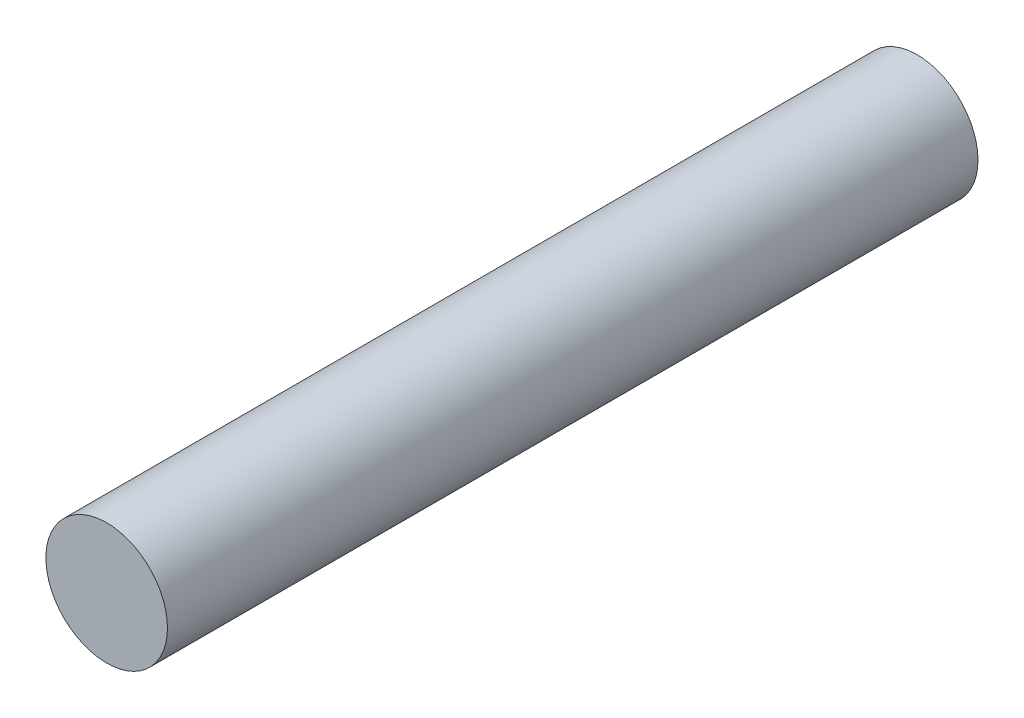
ISO-10303-21;
HEADER;
FILE_DESCRIPTION(('STEP AP214'),'2;1');
FILE_NAME('part.step','',(''),(''),'','','');
FILE_SCHEMA(('AUTOMOTIVE_DESIGN { 1 0 10303 214 1 1 1 1 }'));
ENDSEC;
DATA;
#1=APPLICATION_CONTEXT('core data for automotive mechanical design processes');
#2=APPLICATION_PROTOCOL_DEFINITION('international standard','automotive_design',2000,#1);
#3=PRODUCT_CONTEXT('',#1,'mechanical');
#4=PRODUCT('Part','Part','',(#3));
#5=PRODUCT_RELATED_PRODUCT_CATEGORY('part','',(#4));
#6=PRODUCT_DEFINITION_FORMATION('','',#4);
#7=PRODUCT_DEFINITION_CONTEXT('part definition',#1,'design');
#8=PRODUCT_DEFINITION('design','',#6,#7);
#9=PRODUCT_DEFINITION_SHAPE('','',#8);
#10=(LENGTH_UNIT() NAMED_UNIT(*) SI_UNIT(.MILLI.,.METRE.));
#11=(NAMED_UNIT(*) PLANE_ANGLE_UNIT() SI_UNIT($,.RADIAN.));
#12=(NAMED_UNIT(*) SI_UNIT($,.STERADIAN.) SOLID_ANGLE_UNIT());
#13=UNCERTAINTY_MEASURE_WITH_UNIT(LENGTH_MEASURE(1.E-05),#10,'distance_accuracy_value','');
#14=(GEOMETRIC_REPRESENTATION_CONTEXT(3) GLOBAL_UNCERTAINTY_ASSIGNED_CONTEXT((#13)) GLOBAL_UNIT_ASSIGNED_CONTEXT((#10,
#11,#12)) REPRESENTATION_CONTEXT('',''));
#15=CARTESIAN_POINT('',(0.,0.,0.));
#16=DIRECTION('',(0.,0.,1.));
#17=DIRECTION('',(1.,0.,0.));
#18=AXIS2_PLACEMENT_3D('',#15,#16,#17);
#19=CARTESIAN_POINT('',(0.,0.,31.75));
#20=DIRECTION('',(0.,0.,-1.));
#21=DIRECTION('',(-1.,0.,0.));
#22=AXIS2_PLACEMENT_3D('',#19,#20,#21);
#23=CYLINDRICAL_SURFACE('',#22,4.7625);
#24=CARTESIAN_POINT('',(0.,0.,31.75));
#25=DIRECTION('',(0.,0.,1.));
#26=DIRECTION('',(1.,0.,0.));
#27=AXIS2_PLACEMENT_3D('',#24,#25,#26);
#28=CIRCLE('',#27,4.7625);
#29=CARTESIAN_POINT('',(4.7625,0.,31.75));
#30=VERTEX_POINT('',#29);
#31=EDGE_CURVE('E10',#30,#30,#28,.T.);
#32=ORIENTED_EDGE('',*,*,#31,.F.);
#33=EDGE_LOOP('',(#32));
#34=FACE_BOUND('',#33,.T.);
#35=CARTESIAN_POINT('',(0.,0.,-31.75));
#36=DIRECTION('',(0.,0.,1.));
#37=DIRECTION('',(1.,0.,0.));
#38=AXIS2_PLACEMENT_3D('',#35,#36,#37);
#39=CIRCLE('',#38,4.7625);
#40=CARTESIAN_POINT('',(4.7625,0.,-31.75));
#41=VERTEX_POINT('',#40);
#42=EDGE_CURVE('E40',#41,#41,#39,.T.);
#43=ORIENTED_EDGE('',*,*,#42,.T.);
#44=EDGE_LOOP('',(#43));
#45=FACE_BOUND('',#44,.T.);
#46=ADVANCED_FACE('F37',(#34,#45),#23,.T.);
#47=CARTESIAN_POINT('',(0.,0.,31.75));
#48=DIRECTION('',(0.,0.,1.));
#49=DIRECTION('',(1.,0.,0.));
#50=AXIS2_PLACEMENT_3D('',#47,#48,#49);
#51=PLANE('',#50);
#52=ORIENTED_EDGE('',*,*,#31,.T.);
#53=EDGE_LOOP('',(#52));
#54=FACE_BOUND('',#53,.T.);
#55=ADVANCED_FACE('F54',(#54),#51,.T.);
#56=CARTESIAN_POINT('',(0.,0.,-31.75));
#57=DIRECTION('',(0.,0.,1.));
#58=DIRECTION('',(1.,0.,0.));
#59=AXIS2_PLACEMENT_3D('',#56,#57,#58);
#60=PLANE('',#59);
#61=ORIENTED_EDGE('',*,*,#42,.F.);
#62=EDGE_LOOP('',(#61));
#63=FACE_BOUND('',#62,.T.);
#64=ADVANCED_FACE('F52',(#63),#60,.F.);
#65=CLOSED_SHELL('',(#46,#55,#64));
#66=MANIFOLD_SOLID_BREP('B2',#65);
#67=ADVANCED_BREP_SHAPE_REPRESENTATION('',(#18,#66),#14);
#68=SHAPE_DEFINITION_REPRESENTATION(#9,#67);
ENDSEC;
END-ISO-10303-21;
